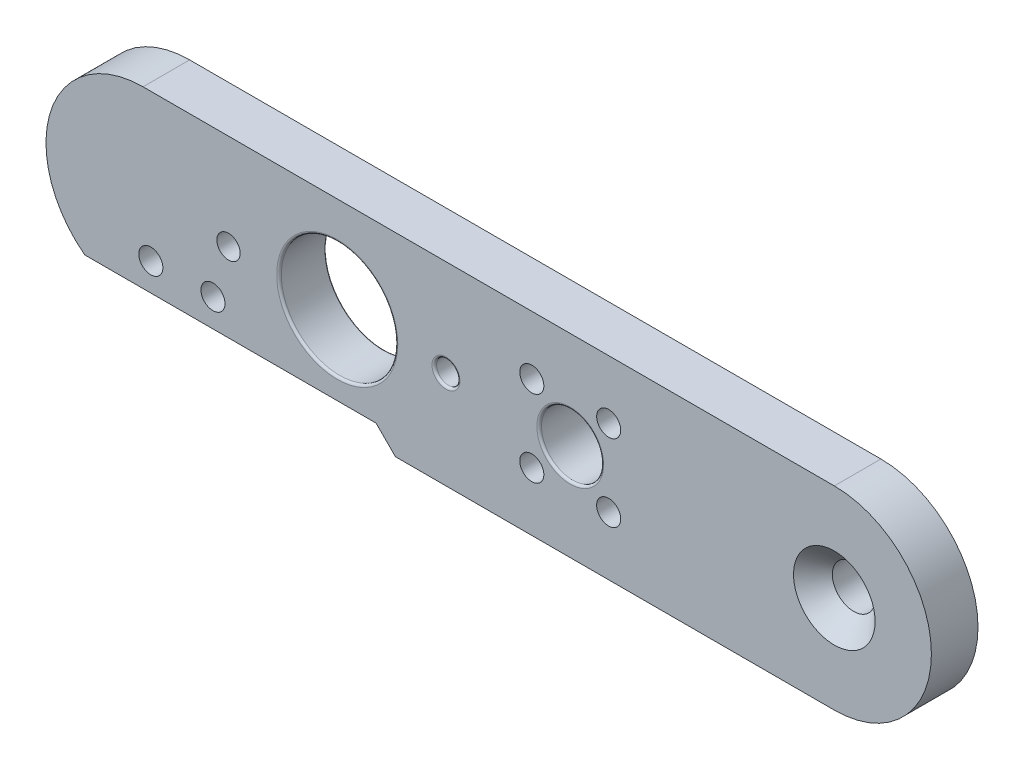
ISO-10303-21;
HEADER;
FILE_DESCRIPTION(('STEP AP214'),'2;1');
FILE_NAME('part.step','',(''),(''),'','','');
FILE_SCHEMA(('AUTOMOTIVE_DESIGN { 1 0 10303 214 1 1 1 1 }'));
ENDSEC;
DATA;
#1=APPLICATION_CONTEXT('core data for automotive mechanical design processes');
#2=APPLICATION_PROTOCOL_DEFINITION('international standard','automotive_design',2000,#1);
#3=PRODUCT_CONTEXT('',#1,'mechanical');
#4=PRODUCT('Part','Part','',(#3));
#5=PRODUCT_RELATED_PRODUCT_CATEGORY('part','',(#4));
#6=PRODUCT_DEFINITION_FORMATION('','',#4);
#7=PRODUCT_DEFINITION_CONTEXT('part definition',#1,'design');
#8=PRODUCT_DEFINITION('design','',#6,#7);
#9=PRODUCT_DEFINITION_SHAPE('','',#8);
#10=(LENGTH_UNIT() NAMED_UNIT(*) SI_UNIT(.MILLI.,.METRE.));
#11=(NAMED_UNIT(*) PLANE_ANGLE_UNIT() SI_UNIT($,.RADIAN.));
#12=(NAMED_UNIT(*) SI_UNIT($,.STERADIAN.) SOLID_ANGLE_UNIT());
#13=UNCERTAINTY_MEASURE_WITH_UNIT(LENGTH_MEASURE(1.E-05),#10,'distance_accuracy_value','');
#14=(GEOMETRIC_REPRESENTATION_CONTEXT(3) GLOBAL_UNCERTAINTY_ASSIGNED_CONTEXT((#13)) GLOBAL_UNIT_ASSIGNED_CONTEXT((#10,
#11,#12)) REPRESENTATION_CONTEXT('',''));
#15=CARTESIAN_POINT('',(0.,0.,0.));
#16=DIRECTION('',(0.,0.,1.));
#17=DIRECTION('',(1.,0.,0.));
#18=AXIS2_PLACEMENT_3D('',#15,#16,#17);
#19=CARTESIAN_POINT('',(-44.5,0.,6.));
#20=DIRECTION('',(0.,0.,-1.));
#21=DIRECTION('',(-1.,0.,0.));
#22=AXIS2_PLACEMENT_3D('',#19,#20,#21);
#23=CYLINDRICAL_SURFACE('',#22,12.5);
#24=DIRECTION('',(0.,0.,1.));
#25=VECTOR('',#24,1.);
#26=CARTESIAN_POINT('',(-52.,-9.99999999999998,0.));
#27=LINE('',#26,#25);
#28=CARTESIAN_POINT('',(-52.0000000000002,-9.9999999999999,0.));
#29=VERTEX_POINT('',#28);
#30=CARTESIAN_POINT('',(-52.,-9.99999999999998,6.));
#31=VERTEX_POINT('',#30);
#32=EDGE_CURVE('E86',#29,#31,#27,.T.);
#33=ORIENTED_EDGE('',*,*,#32,.T.);
#34=CARTESIAN_POINT('',(-44.5,0.,6.));
#35=DIRECTION('',(0.,0.,1.));
#36=DIRECTION('',(1.,0.,0.));
#37=AXIS2_PLACEMENT_3D('',#34,#35,#36);
#38=CIRCLE('',#37,12.5);
#39=CARTESIAN_POINT('',(-44.5,12.5,6.));
#40=VERTEX_POINT('',#39);
#41=EDGE_CURVE('E173',#40,#31,#38,.T.);
#42=ORIENTED_EDGE('',*,*,#41,.F.);
#43=DIRECTION('',(0.,0.,-1.));
#44=VECTOR('',#43,1.);
#45=CARTESIAN_POINT('',(-44.5,12.5,6.));
#46=LINE('',#45,#44);
#47=CARTESIAN_POINT('',(-44.5,12.5,0.));
#48=VERTEX_POINT('',#47);
#49=EDGE_CURVE('E183',#40,#48,#46,.T.);
#50=ORIENTED_EDGE('',*,*,#49,.T.);
#51=CARTESIAN_POINT('',(-44.5,0.,0.));
#52=DIRECTION('',(0.,0.,1.));
#53=DIRECTION('',(1.,0.,0.));
#54=AXIS2_PLACEMENT_3D('',#51,#52,#53);
#55=CIRCLE('',#54,12.5);
#56=EDGE_CURVE('E170',#48,#29,#55,.T.);
#57=ORIENTED_EDGE('',*,*,#56,.T.);
#58=EDGE_LOOP('',(#33,#42,#50,#57));
#59=FACE_BOUND('',#58,.T.);
#60=ADVANCED_FACE('F70',(#59),#23,.T.);
#61=CARTESIAN_POINT('',(-44.5,-12.5,6.));
#62=DIRECTION('',(0.,1.,0.));
#63=DIRECTION('',(-1.,0.,0.));
#64=AXIS2_PLACEMENT_3D('',#61,#62,#63);
#65=PLANE('',#64);
#66=DIRECTION('',(0.,0.,1.));
#67=VECTOR('',#66,1.);
#68=CARTESIAN_POINT('',(-12.,-12.5,0.));
#69=LINE('',#68,#67);
#70=CARTESIAN_POINT('',(-12.,-12.5,0.));
#71=VERTEX_POINT('',#70);
#72=CARTESIAN_POINT('',(-12.,-12.5,6.));
#73=VERTEX_POINT('',#72);
#74=EDGE_CURVE('E167',#71,#73,#69,.T.);
#75=ORIENTED_EDGE('',*,*,#74,.F.);
#76=DIRECTION('',(1.,0.,0.));
#77=VECTOR('',#76,1.);
#78=CARTESIAN_POINT('',(-44.5,-12.5,0.));
#79=LINE('',#78,#77);
#80=CARTESIAN_POINT('',(44.5,-12.5,0.));
#81=VERTEX_POINT('',#80);
#82=EDGE_CURVE('E153',#71,#81,#79,.T.);
#83=ORIENTED_EDGE('',*,*,#82,.T.);
#84=DIRECTION('',(0.,0.,-1.));
#85=VECTOR('',#84,1.);
#86=CARTESIAN_POINT('',(44.5,-12.5,6.));
#87=LINE('',#86,#85);
#88=CARTESIAN_POINT('',(44.5,-12.5,6.));
#89=VERTEX_POINT('',#88);
#90=EDGE_CURVE('E198',#89,#81,#87,.T.);
#91=ORIENTED_EDGE('',*,*,#90,.F.);
#92=DIRECTION('',(1.,0.,0.));
#93=VECTOR('',#92,1.);
#94=CARTESIAN_POINT('',(-44.5,-12.5,6.));
#95=LINE('',#94,#93);
#96=EDGE_CURVE('E117',#73,#89,#95,.T.);
#97=ORIENTED_EDGE('',*,*,#96,.F.);
#98=EDGE_LOOP('',(#75,#83,#91,#97));
#99=FACE_BOUND('',#98,.T.);
#100=ADVANCED_FACE('F261',(#99),#65,.F.);
#101=CARTESIAN_POINT('',(-44.5,0.,6.));
#102=DIRECTION('',(0.,0.,1.));
#103=DIRECTION('',(1.,0.,0.));
#104=AXIS2_PLACEMENT_3D('',#101,#102,#103);
#105=PLANE('',#104);
#106=CARTESIAN_POINT('',(10.5,0.,6.));
#107=DIRECTION('',(0.,0.,1.));
#108=DIRECTION('',(1.,0.,0.));
#109=AXIS2_PLACEMENT_3D('',#106,#107,#108);
#110=CIRCLE('',#109,4.30000000000001);
#111=CARTESIAN_POINT('',(14.8,0.,6.));
#112=VERTEX_POINT('',#111);
#113=EDGE_CURVE('E230',#112,#112,#110,.F.);
#114=ORIENTED_EDGE('',*,*,#113,.T.);
#115=EDGE_LOOP('',(#114));
#116=FACE_BOUND('',#115,.T.);
#117=CARTESIAN_POINT('',(-5.50015578929164,0.0828288287098955,6.));
#118=DIRECTION('',(0.,0.,1.));
#119=DIRECTION('',(1.,0.,0.));
#120=AXIS2_PLACEMENT_3D('',#117,#118,#119);
#121=CIRCLE('',#120,1.8);
#122=CARTESIAN_POINT('',(-3.70015578929164,0.0828288287098955,6.));
#123=VERTEX_POINT('',#122);
#124=EDGE_CURVE('E226',#123,#123,#121,.F.);
#125=ORIENTED_EDGE('',*,*,#124,.T.);
#126=EDGE_LOOP('',(#125));
#127=FACE_BOUND('',#126,.T.);
#128=CARTESIAN_POINT('',(-19.5,0.1762321266267,6.));
#129=DIRECTION('',(0.,0.,1.));
#130=DIRECTION('',(1.,0.,0.));
#131=AXIS2_PLACEMENT_3D('',#128,#129,#130);
#132=CIRCLE('',#131,7.8);
#133=CARTESIAN_POINT('',(-11.7,0.1762321266267,6.));
#134=VERTEX_POINT('',#133);
#135=EDGE_CURVE('E222',#134,#134,#132,.F.);
#136=ORIENTED_EDGE('',*,*,#135,.T.);
#137=EDGE_LOOP('',(#136));
#138=FACE_BOUND('',#137,.T.);
#139=CARTESIAN_POINT('',(44.5,0.,6.));
#140=DIRECTION('',(0.,0.,1.));
#141=DIRECTION('',(1.,0.,0.));
#142=AXIS2_PLACEMENT_3D('',#139,#140,#141);
#143=CIRCLE('',#142,5.25);
#144=CARTESIAN_POINT('',(49.75,0.,6.));
#145=VERTEX_POINT('',#144);
#146=EDGE_CURVE('E432',#145,#145,#143,.T.);
#147=ORIENTED_EDGE('',*,*,#146,.F.);
#148=EDGE_LOOP('',(#147));
#149=FACE_BOUND('',#148,.T.);
#150=CARTESIAN_POINT('',(-43.5,-6.41374283085084,6.));
#151=DIRECTION('',(0.,0.,1.));
#152=DIRECTION('',(1.,0.,0.));
#153=AXIS2_PLACEMENT_3D('',#150,#151,#152);
#154=CIRCLE('',#153,1.55);
#155=CARTESIAN_POINT('',(-41.95,-6.41374283085084,6.));
#156=VERTEX_POINT('',#155);
#157=EDGE_CURVE('E378',#156,#156,#154,.T.);
#158=ORIENTED_EDGE('',*,*,#157,.F.);
#159=EDGE_LOOP('',(#158));
#160=FACE_BOUND('',#159,.T.);
#161=CARTESIAN_POINT('',(-35.5,-6.41374283085084,6.));
#162=DIRECTION('',(0.,0.,1.));
#163=DIRECTION('',(1.,0.,0.));
#164=AXIS2_PLACEMENT_3D('',#161,#162,#163);
#165=CIRCLE('',#164,1.55);
#166=CARTESIAN_POINT('',(-33.95,-6.41374283085084,6.));
#167=VERTEX_POINT('',#166);
#168=EDGE_CURVE('E384',#167,#167,#165,.T.);
#169=ORIENTED_EDGE('',*,*,#168,.F.);
#170=EDGE_LOOP('',(#169));
#171=FACE_BOUND('',#170,.T.);
#172=CARTESIAN_POINT('',(-33.5,0.176232126626699,6.));
#173=DIRECTION('',(0.,0.,1.));
#174=DIRECTION('',(1.,0.,0.));
#175=AXIS2_PLACEMENT_3D('',#172,#173,#174);
#176=CIRCLE('',#175,1.5);
#177=CARTESIAN_POINT('',(-32.,0.176232126626699,6.));
#178=VERTEX_POINT('',#177);
#179=EDGE_CURVE('E372',#178,#178,#176,.T.);
#180=ORIENTED_EDGE('',*,*,#179,.F.);
#181=EDGE_LOOP('',(#180));
#182=FACE_BOUND('',#181,.T.);
#183=CARTESIAN_POINT('',(5.55025253169416,4.94974746830582,6.));
#184=DIRECTION('',(0.,0.,1.));
#185=DIRECTION('',(1.,0.,0.));
#186=AXIS2_PLACEMENT_3D('',#183,#184,#185);
#187=CIRCLE('',#186,1.55);
#188=CARTESIAN_POINT('',(7.10025253169416,4.94974746830582,6.));
#189=VERTEX_POINT('',#188);
#190=EDGE_CURVE('E336',#189,#189,#187,.T.);
#191=ORIENTED_EDGE('',*,*,#190,.F.);
#192=EDGE_LOOP('',(#191));
#193=FACE_BOUND('',#192,.T.);
#194=CARTESIAN_POINT('',(15.4497474683058,4.94974746830596,6.));
#195=DIRECTION('',(0.,0.,1.));
#196=DIRECTION('',(1.,0.,0.));
#197=AXIS2_PLACEMENT_3D('',#194,#195,#196);
#198=CIRCLE('',#197,1.55);
#199=CARTESIAN_POINT('',(16.9997474683058,4.94974746830596,6.));
#200=VERTEX_POINT('',#199);
#201=EDGE_CURVE('E165',#200,#200,#198,.T.);
#202=ORIENTED_EDGE('',*,*,#201,.F.);
#203=EDGE_LOOP('',(#202));
#204=FACE_BOUND('',#203,.T.);
#205=CARTESIAN_POINT('',(15.4497474683059,-4.94974746830572,6.));
#206=DIRECTION('',(0.,0.,1.));
#207=DIRECTION('',(1.,0.,0.));
#208=AXIS2_PLACEMENT_3D('',#205,#206,#207);
#209=CIRCLE('',#208,1.55);
#210=CARTESIAN_POINT('',(16.999747468306,-4.94974746830572,6.));
#211=VERTEX_POINT('',#210);
#212=EDGE_CURVE('E351',#211,#211,#209,.T.);
#213=ORIENTED_EDGE('',*,*,#212,.F.);
#214=EDGE_LOOP('',(#213));
#215=FACE_BOUND('',#214,.T.);
#216=CARTESIAN_POINT('',(5.55025253169426,-4.94974746830579,6.));
#217=DIRECTION('',(0.,0.,1.));
#218=DIRECTION('',(1.,0.,0.));
#219=AXIS2_PLACEMENT_3D('',#216,#217,#218);
#220=CIRCLE('',#219,1.55);
#221=CARTESIAN_POINT('',(7.10025253169426,-4.94974746830579,6.));
#222=VERTEX_POINT('',#221);
#223=EDGE_CURVE('E335',#222,#222,#220,.T.);
#224=ORIENTED_EDGE('',*,*,#223,.F.);
#225=EDGE_LOOP('',(#224));
#226=FACE_BOUND('',#225,.T.);
#227=DIRECTION('',(1.,0.,0.));
#228=VECTOR('',#227,1.);
#229=CARTESIAN_POINT('',(0.,-10.,6.));
#230=LINE('',#229,#228);
#231=CARTESIAN_POINT('',(-14.5,-9.99999999999999,6.));
#232=VERTEX_POINT('',#231);
#233=EDGE_CURVE('E155',#31,#232,#230,.T.);
#234=ORIENTED_EDGE('',*,*,#233,.T.);
#235=DIRECTION('',(0.707106781186551,-0.707106781186544,0.));
#236=VECTOR('',#235,1.);
#237=CARTESIAN_POINT('',(-12.2499999999999,-12.25,6.));
#238=LINE('',#237,#236);
#239=EDGE_CURVE('E146',#232,#73,#238,.T.);
#240=ORIENTED_EDGE('',*,*,#239,.T.);
#241=ORIENTED_EDGE('',*,*,#96,.T.);
#242=CARTESIAN_POINT('',(44.5,0.,6.));
#243=DIRECTION('',(0.,0.,1.));
#244=DIRECTION('',(1.,0.,0.));
#245=AXIS2_PLACEMENT_3D('',#242,#243,#244);
#246=CIRCLE('',#245,12.5);
#247=CARTESIAN_POINT('',(44.5,12.5,6.));
#248=VERTEX_POINT('',#247);
#249=EDGE_CURVE('E178',#89,#248,#246,.T.);
#250=ORIENTED_EDGE('',*,*,#249,.T.);
#251=DIRECTION('',(-1.,0.,0.));
#252=VECTOR('',#251,1.);
#253=CARTESIAN_POINT('',(-44.5,12.5,6.));
#254=LINE('',#253,#252);
#255=EDGE_CURVE('E95',#248,#40,#254,.T.);
#256=ORIENTED_EDGE('',*,*,#255,.T.);
#257=ORIENTED_EDGE('',*,*,#41,.T.);
#258=EDGE_LOOP('',(#234,#240,#241,#250,#256,#257));
#259=FACE_BOUND('',#258,.T.);
#260=ADVANCED_FACE('F267',(#116,#127,#138,#149,#160,#171,#182,#193,#204,#215,#226,#259),#105,.T.);
#261=CARTESIAN_POINT('',(-44.5,0.,0.));
#262=DIRECTION('',(0.,0.,1.));
#263=DIRECTION('',(1.,0.,0.));
#264=AXIS2_PLACEMENT_3D('',#261,#262,#263);
#265=PLANE('',#264);
#266=CARTESIAN_POINT('',(-5.50015578929164,0.0828288287098955,0.));
#267=DIRECTION('',(0.,0.,1.));
#268=DIRECTION('',(1.,0.,0.));
#269=AXIS2_PLACEMENT_3D('',#266,#267,#268);
#270=CIRCLE('',#269,1.8);
#271=CARTESIAN_POINT('',(-3.70015578929164,0.0828288287098955,0.));
#272=VERTEX_POINT('',#271);
#273=EDGE_CURVE('E79',#272,#272,#270,.T.);
#274=ORIENTED_EDGE('',*,*,#273,.T.);
#275=EDGE_LOOP('',(#274));
#276=FACE_BOUND('',#275,.T.);
#277=CARTESIAN_POINT('',(-19.5,0.1762321266267,0.));
#278=DIRECTION('',(0.,0.,1.));
#279=DIRECTION('',(1.,0.,0.));
#280=AXIS2_PLACEMENT_3D('',#277,#278,#279);
#281=CIRCLE('',#280,7.6);
#282=CARTESIAN_POINT('',(-11.9,0.1762321266267,0.));
#283=VERTEX_POINT('',#282);
#284=EDGE_CURVE('E206',#283,#283,#281,.T.);
#285=ORIENTED_EDGE('',*,*,#284,.T.);
#286=EDGE_LOOP('',(#285));
#287=FACE_BOUND('',#286,.T.);
#288=CARTESIAN_POINT('',(10.5,0.,0.));
#289=DIRECTION('',(0.,0.,1.));
#290=DIRECTION('',(1.,0.,0.));
#291=AXIS2_PLACEMENT_3D('',#288,#289,#290);
#292=CIRCLE('',#291,4.10000000000001);
#293=CARTESIAN_POINT('',(14.6,0.,0.));
#294=VERTEX_POINT('',#293);
#295=EDGE_CURVE('E202',#294,#294,#292,.T.);
#296=ORIENTED_EDGE('',*,*,#295,.T.);
#297=EDGE_LOOP('',(#296));
#298=FACE_BOUND('',#297,.T.);
#299=CARTESIAN_POINT('',(44.5,0.,0.));
#300=DIRECTION('',(0.,0.,1.));
#301=DIRECTION('',(1.,0.,0.));
#302=AXIS2_PLACEMENT_3D('',#299,#300,#301);
#303=CIRCLE('',#302,2.75);
#304=CARTESIAN_POINT('',(47.25,0.,0.));
#305=VERTEX_POINT('',#304);
#306=EDGE_CURVE('E306',#305,#305,#303,.T.);
#307=ORIENTED_EDGE('',*,*,#306,.T.);
#308=EDGE_LOOP('',(#307));
#309=FACE_BOUND('',#308,.T.);
#310=CARTESIAN_POINT('',(-43.5,-6.41374283085084,0.));
#311=DIRECTION('',(0.,0.,1.));
#312=DIRECTION('',(1.,0.,0.));
#313=AXIS2_PLACEMENT_3D('',#310,#311,#312);
#314=CIRCLE('',#313,2.99999999999999);
#315=CARTESIAN_POINT('',(-40.5,-6.41374283085084,0.));
#316=VERTEX_POINT('',#315);
#317=EDGE_CURVE('E310',#316,#316,#314,.T.);
#318=ORIENTED_EDGE('',*,*,#317,.T.);
#319=EDGE_LOOP('',(#318));
#320=FACE_BOUND('',#319,.T.);
#321=CARTESIAN_POINT('',(-35.5,-6.41374283085084,0.));
#322=DIRECTION('',(0.,0.,1.));
#323=DIRECTION('',(1.,0.,0.));
#324=AXIS2_PLACEMENT_3D('',#321,#322,#323);
#325=CIRCLE('',#324,2.99999999999999);
#326=CARTESIAN_POINT('',(-32.5,-6.41374283085084,0.));
#327=VERTEX_POINT('',#326);
#328=EDGE_CURVE('E314',#327,#327,#325,.T.);
#329=ORIENTED_EDGE('',*,*,#328,.T.);
#330=EDGE_LOOP('',(#329));
#331=FACE_BOUND('',#330,.T.);
#332=CARTESIAN_POINT('',(-33.5,0.176232126626699,0.));
#333=DIRECTION('',(0.,0.,1.));
#334=DIRECTION('',(1.,0.,0.));
#335=AXIS2_PLACEMENT_3D('',#332,#333,#334);
#336=CIRCLE('',#335,1.5);
#337=CARTESIAN_POINT('',(-32.,0.176232126626699,0.));
#338=VERTEX_POINT('',#337);
#339=EDGE_CURVE('E318',#338,#338,#336,.T.);
#340=ORIENTED_EDGE('',*,*,#339,.T.);
#341=EDGE_LOOP('',(#340));
#342=FACE_BOUND('',#341,.T.);
#343=CARTESIAN_POINT('',(5.55025253169416,4.94974746830582,0.));
#344=DIRECTION('',(0.,0.,1.));
#345=DIRECTION('',(1.,0.,0.));
#346=AXIS2_PLACEMENT_3D('',#343,#344,#345);
#347=CIRCLE('',#346,1.55);
#348=CARTESIAN_POINT('',(7.10025253169416,4.94974746830582,0.));
#349=VERTEX_POINT('',#348);
#350=EDGE_CURVE('E322',#349,#349,#347,.T.);
#351=ORIENTED_EDGE('',*,*,#350,.T.);
#352=EDGE_LOOP('',(#351));
#353=FACE_BOUND('',#352,.T.);
#354=CARTESIAN_POINT('',(15.4497474683058,4.94974746830596,0.));
#355=DIRECTION('',(0.,0.,1.));
#356=DIRECTION('',(1.,0.,0.));
#357=AXIS2_PLACEMENT_3D('',#354,#355,#356);
#358=CIRCLE('',#357,1.55);
#359=CARTESIAN_POINT('',(16.9997474683058,4.94974746830596,0.));
#360=VERTEX_POINT('',#359);
#361=EDGE_CURVE('E326',#360,#360,#358,.T.);
#362=ORIENTED_EDGE('',*,*,#361,.T.);
#363=EDGE_LOOP('',(#362));
#364=FACE_BOUND('',#363,.T.);
#365=CARTESIAN_POINT('',(15.4497474683059,-4.94974746830572,0.));
#366=DIRECTION('',(0.,0.,1.));
#367=DIRECTION('',(1.,0.,0.));
#368=AXIS2_PLACEMENT_3D('',#365,#366,#367);
#369=CIRCLE('',#368,1.55);
#370=CARTESIAN_POINT('',(16.999747468306,-4.94974746830572,0.));
#371=VERTEX_POINT('',#370);
#372=EDGE_CURVE('E161',#371,#371,#369,.T.);
#373=ORIENTED_EDGE('',*,*,#372,.T.);
#374=EDGE_LOOP('',(#373));
#375=FACE_BOUND('',#374,.T.);
#376=CARTESIAN_POINT('',(5.55025253169426,-4.94974746830579,0.));
#377=DIRECTION('',(0.,0.,1.));
#378=DIRECTION('',(1.,0.,0.));
#379=AXIS2_PLACEMENT_3D('',#376,#377,#378);
#380=CIRCLE('',#379,1.55);
#381=CARTESIAN_POINT('',(7.10025253169426,-4.94974746830579,0.));
#382=VERTEX_POINT('',#381);
#383=EDGE_CURVE('E332',#382,#382,#380,.T.);
#384=ORIENTED_EDGE('',*,*,#383,.T.);
#385=EDGE_LOOP('',(#384));
#386=FACE_BOUND('',#385,.T.);
#387=DIRECTION('',(0.707106781186551,-0.707106781186544,0.));
#388=VECTOR('',#387,1.);
#389=CARTESIAN_POINT('',(-12.2499999999999,-12.25,0.));
#390=LINE('',#389,#388);
#391=CARTESIAN_POINT('',(-14.5,-9.99999999999999,0.));
#392=VERTEX_POINT('',#391);
#393=EDGE_CURVE('E141',#392,#71,#390,.T.);
#394=ORIENTED_EDGE('',*,*,#393,.F.);
#395=DIRECTION('',(1.,0.,0.));
#396=VECTOR('',#395,1.);
#397=CARTESIAN_POINT('',(0.,-10.,0.));
#398=LINE('',#397,#396);
#399=EDGE_CURVE('E131',#29,#392,#398,.T.);
#400=ORIENTED_EDGE('',*,*,#399,.F.);
#401=ORIENTED_EDGE('',*,*,#56,.F.);
#402=DIRECTION('',(-1.,0.,0.));
#403=VECTOR('',#402,1.);
#404=CARTESIAN_POINT('',(-44.5,12.5,0.));
#405=LINE('',#404,#403);
#406=CARTESIAN_POINT('',(44.5,12.5,0.));
#407=VERTEX_POINT('',#406);
#408=EDGE_CURVE('E112',#407,#48,#405,.T.);
#409=ORIENTED_EDGE('',*,*,#408,.F.);
#410=CARTESIAN_POINT('',(44.5,0.,0.));
#411=DIRECTION('',(0.,0.,1.));
#412=DIRECTION('',(1.,0.,0.));
#413=AXIS2_PLACEMENT_3D('',#410,#411,#412);
#414=CIRCLE('',#413,12.5);
#415=EDGE_CURVE('E188',#81,#407,#414,.T.);
#416=ORIENTED_EDGE('',*,*,#415,.F.);
#417=ORIENTED_EDGE('',*,*,#82,.F.);
#418=EDGE_LOOP('',(#394,#400,#401,#409,#416,#417));
#419=FACE_BOUND('',#418,.T.);
#420=ADVANCED_FACE('F151',(#276,#287,#298,#309,#320,#331,#342,#353,#364,#375,#386,#419),#265,.F.);
#421=CARTESIAN_POINT('',(44.5,0.,6.));
#422=DIRECTION('',(0.,0.,-1.));
#423=DIRECTION('',(-1.,0.,0.));
#424=AXIS2_PLACEMENT_3D('',#421,#422,#423);
#425=CYLINDRICAL_SURFACE('',#424,12.5);
#426=ORIENTED_EDGE('',*,*,#415,.T.);
#427=DIRECTION('',(0.,0.,-1.));
#428=VECTOR('',#427,1.);
#429=CARTESIAN_POINT('',(44.5,12.5,6.));
#430=LINE('',#429,#428);
#431=EDGE_CURVE('E195',#248,#407,#430,.T.);
#432=ORIENTED_EDGE('',*,*,#431,.F.);
#433=ORIENTED_EDGE('',*,*,#249,.F.);
#434=ORIENTED_EDGE('',*,*,#90,.T.);
#435=EDGE_LOOP('',(#426,#432,#433,#434));
#436=FACE_BOUND('',#435,.T.);
#437=ADVANCED_FACE('F301',(#436),#425,.T.);
#438=CARTESIAN_POINT('',(-44.5,12.5,6.));
#439=DIRECTION('',(0.,-1.,0.));
#440=DIRECTION('',(1.,0.,0.));
#441=AXIS2_PLACEMENT_3D('',#438,#439,#440);
#442=PLANE('',#441);
#443=ORIENTED_EDGE('',*,*,#408,.T.);
#444=ORIENTED_EDGE('',*,*,#49,.F.);
#445=ORIENTED_EDGE('',*,*,#255,.F.);
#446=ORIENTED_EDGE('',*,*,#431,.T.);
#447=EDGE_LOOP('',(#443,#444,#445,#446));
#448=FACE_BOUND('',#447,.T.);
#449=ADVANCED_FACE('F461',(#448),#442,.F.);
#450=CARTESIAN_POINT('',(-12.2499999999999,-12.25,0.));
#451=DIRECTION('',(-0.707106781186544,-0.707106781186551,0.));
#452=DIRECTION('',(0.707106781186551,-0.707106781186544,0.));
#453=AXIS2_PLACEMENT_3D('',#450,#451,#452);
#454=PLANE('',#453);
#455=ORIENTED_EDGE('',*,*,#239,.F.);
#456=DIRECTION('',(0.,0.,1.));
#457=VECTOR('',#456,1.);
#458=CARTESIAN_POINT('',(-14.5,-9.99999999999999,0.));
#459=LINE('',#458,#457);
#460=EDGE_CURVE('E134',#392,#232,#459,.T.);
#461=ORIENTED_EDGE('',*,*,#460,.F.);
#462=ORIENTED_EDGE('',*,*,#393,.T.);
#463=ORIENTED_EDGE('',*,*,#74,.T.);
#464=EDGE_LOOP('',(#455,#461,#462,#463));
#465=FACE_BOUND('',#464,.T.);
#466=ADVANCED_FACE('F144',(#465),#454,.T.);
#467=CARTESIAN_POINT('',(0.,-10.,0.));
#468=DIRECTION('',(0.,-1.,0.));
#469=DIRECTION('',(1.,0.,0.));
#470=AXIS2_PLACEMENT_3D('',#467,#468,#469);
#471=PLANE('',#470);
#472=ORIENTED_EDGE('',*,*,#233,.F.);
#473=ORIENTED_EDGE('',*,*,#32,.F.);
#474=ORIENTED_EDGE('',*,*,#399,.T.);
#475=ORIENTED_EDGE('',*,*,#460,.T.);
#476=EDGE_LOOP('',(#472,#473,#474,#475));
#477=FACE_BOUND('',#476,.T.);
#478=ADVANCED_FACE('F133',(#477),#471,.T.);
#479=CARTESIAN_POINT('',(5.55025253169426,-4.94974746830579,0.));
#480=DIRECTION('',(0.,0.,1.));
#481=DIRECTION('',(1.,0.,0.));
#482=AXIS2_PLACEMENT_3D('',#479,#480,#481);
#483=CYLINDRICAL_SURFACE('',#482,1.55);
#484=ORIENTED_EDGE('',*,*,#383,.F.);
#485=EDGE_LOOP('',(#484));
#486=FACE_BOUND('',#485,.T.);
#487=ORIENTED_EDGE('',*,*,#223,.T.);
#488=EDGE_LOOP('',(#487));
#489=FACE_BOUND('',#488,.T.);
#490=ADVANCED_FACE('F293',(#486,#489),#483,.F.);
#491=CARTESIAN_POINT('',(10.5,0.,0.));
#492=DIRECTION('',(0.,0.,1.));
#493=DIRECTION('',(1.,0.,0.));
#494=AXIS2_PLACEMENT_3D('',#491,#492,#493);
#495=CYLINDRICAL_SURFACE('',#494,4.00000000000001);
#496=CARTESIAN_POINT('',(10.5,0.,5.7));
#497=DIRECTION('',(0.,0.,1.));
#498=DIRECTION('',(1.,0.,0.));
#499=AXIS2_PLACEMENT_3D('',#496,#497,#498);
#500=CIRCLE('',#499,4.00000000000001);
#501=CARTESIAN_POINT('',(14.5,0.,5.7));
#502=VERTEX_POINT('',#501);
#503=EDGE_CURVE('E218',#502,#502,#500,.T.);
#504=ORIENTED_EDGE('',*,*,#503,.T.);
#505=EDGE_LOOP('',(#504));
#506=FACE_BOUND('',#505,.T.);
#507=CARTESIAN_POINT('',(10.5,0.,0.1));
#508=DIRECTION('',(0.,0.,1.));
#509=DIRECTION('',(1.,0.,0.));
#510=AXIS2_PLACEMENT_3D('',#507,#508,#509);
#511=CIRCLE('',#510,4.00000000000001);
#512=CARTESIAN_POINT('',(14.5,0.,0.1));
#513=VERTEX_POINT('',#512);
#514=EDGE_CURVE('E214',#513,#513,#511,.F.);
#515=ORIENTED_EDGE('',*,*,#514,.T.);
#516=EDGE_LOOP('',(#515));
#517=FACE_BOUND('',#516,.T.);
#518=ADVANCED_FACE('F289',(#506,#517),#495,.F.);
#519=CARTESIAN_POINT('',(15.4497474683059,-4.94974746830572,0.));
#520=DIRECTION('',(0.,0.,1.));
#521=DIRECTION('',(1.,0.,0.));
#522=AXIS2_PLACEMENT_3D('',#519,#520,#521);
#523=CYLINDRICAL_SURFACE('',#522,1.55);
#524=ORIENTED_EDGE('',*,*,#372,.F.);
#525=EDGE_LOOP('',(#524));
#526=FACE_BOUND('',#525,.T.);
#527=ORIENTED_EDGE('',*,*,#212,.T.);
#528=EDGE_LOOP('',(#527));
#529=FACE_BOUND('',#528,.T.);
#530=ADVANCED_FACE('F292',(#526,#529),#523,.F.);
#531=CARTESIAN_POINT('',(15.4497474683058,4.94974746830596,0.));
#532=DIRECTION('',(0.,0.,1.));
#533=DIRECTION('',(1.,0.,0.));
#534=AXIS2_PLACEMENT_3D('',#531,#532,#533);
#535=CYLINDRICAL_SURFACE('',#534,1.55);
#536=ORIENTED_EDGE('',*,*,#361,.F.);
#537=EDGE_LOOP('',(#536));
#538=FACE_BOUND('',#537,.T.);
#539=ORIENTED_EDGE('',*,*,#201,.T.);
#540=EDGE_LOOP('',(#539));
#541=FACE_BOUND('',#540,.T.);
#542=ADVANCED_FACE('F474',(#538,#541),#535,.F.);
#543=CARTESIAN_POINT('',(5.55025253169416,4.94974746830582,0.));
#544=DIRECTION('',(0.,0.,1.));
#545=DIRECTION('',(1.,0.,0.));
#546=AXIS2_PLACEMENT_3D('',#543,#544,#545);
#547=CYLINDRICAL_SURFACE('',#546,1.55);
#548=ORIENTED_EDGE('',*,*,#350,.F.);
#549=EDGE_LOOP('',(#548));
#550=FACE_BOUND('',#549,.T.);
#551=ORIENTED_EDGE('',*,*,#190,.T.);
#552=EDGE_LOOP('',(#551));
#553=FACE_BOUND('',#552,.T.);
#554=ADVANCED_FACE('F478',(#550,#553),#547,.F.);
#555=CARTESIAN_POINT('',(-19.5,0.1762321266267,0.));
#556=DIRECTION('',(0.,0.,1.));
#557=DIRECTION('',(1.,0.,0.));
#558=AXIS2_PLACEMENT_3D('',#555,#556,#557);
#559=CYLINDRICAL_SURFACE('',#558,7.5);
#560=CARTESIAN_POINT('',(-19.5,0.1762321266267,5.7));
#561=DIRECTION('',(0.,0.,1.));
#562=DIRECTION('',(1.,0.,0.));
#563=AXIS2_PLACEMENT_3D('',#560,#561,#562);
#564=CIRCLE('',#563,7.5);
#565=CARTESIAN_POINT('',(-12.,0.1762321266267,5.7));
#566=VERTEX_POINT('',#565);
#567=EDGE_CURVE('E12',#566,#566,#564,.T.);
#568=ORIENTED_EDGE('',*,*,#567,.T.);
#569=EDGE_LOOP('',(#568));
#570=FACE_BOUND('',#569,.T.);
#571=CARTESIAN_POINT('',(-19.5,0.1762321266267,0.1));
#572=DIRECTION('',(0.,0.,1.));
#573=DIRECTION('',(1.,0.,0.));
#574=AXIS2_PLACEMENT_3D('',#571,#572,#573);
#575=CIRCLE('',#574,7.5);
#576=CARTESIAN_POINT('',(-12.,0.1762321266267,0.1));
#577=VERTEX_POINT('',#576);
#578=EDGE_CURVE('E210',#577,#577,#575,.F.);
#579=ORIENTED_EDGE('',*,*,#578,.T.);
#580=EDGE_LOOP('',(#579));
#581=FACE_BOUND('',#580,.T.);
#582=ADVANCED_FACE('F484',(#570,#581),#559,.F.);
#583=CARTESIAN_POINT('',(-33.5,0.176232126626699,6.));
#584=DIRECTION('',(0.,0.,1.));
#585=DIRECTION('',(1.,0.,0.));
#586=AXIS2_PLACEMENT_3D('',#583,#584,#585);
#587=CYLINDRICAL_SURFACE('',#586,1.5);
#588=ORIENTED_EDGE('',*,*,#339,.F.);
#589=EDGE_LOOP('',(#588));
#590=FACE_BOUND('',#589,.T.);
#591=ORIENTED_EDGE('',*,*,#179,.T.);
#592=EDGE_LOOP('',(#591));
#593=FACE_BOUND('',#592,.T.);
#594=ADVANCED_FACE('F488',(#590,#593),#587,.F.);
#595=CARTESIAN_POINT('',(-5.50015578929164,0.0828288287098955,6.));
#596=DIRECTION('',(0.,0.,1.));
#597=DIRECTION('',(1.,0.,0.));
#598=AXIS2_PLACEMENT_3D('',#595,#596,#597);
#599=CYLINDRICAL_SURFACE('',#598,1.5);
#600=CARTESIAN_POINT('',(-5.50015578929164,0.0828288287098955,5.7));
#601=DIRECTION('',(0.,0.,1.));
#602=DIRECTION('',(1.,0.,0.));
#603=AXIS2_PLACEMENT_3D('',#600,#601,#602);
#604=CIRCLE('',#603,1.5);
#605=CARTESIAN_POINT('',(-4.00015578929164,0.0828288287098955,5.7));
#606=VERTEX_POINT('',#605);
#607=EDGE_CURVE('E238',#606,#606,#604,.T.);
#608=ORIENTED_EDGE('',*,*,#607,.T.);
#609=EDGE_LOOP('',(#608));
#610=FACE_BOUND('',#609,.T.);
#611=CARTESIAN_POINT('',(-5.50015578929164,0.0828288287098955,0.3));
#612=DIRECTION('',(0.,0.,1.));
#613=DIRECTION('',(1.,0.,0.));
#614=AXIS2_PLACEMENT_3D('',#611,#612,#613);
#615=CIRCLE('',#614,1.5);
#616=CARTESIAN_POINT('',(-4.00015578929164,0.0828288287098955,0.3));
#617=VERTEX_POINT('',#616);
#618=EDGE_CURVE('E234',#617,#617,#615,.F.);
#619=ORIENTED_EDGE('',*,*,#618,.T.);
#620=EDGE_LOOP('',(#619));
#621=FACE_BOUND('',#620,.T.);
#622=ADVANCED_FACE('F492',(#610,#621),#599,.F.);
#623=CARTESIAN_POINT('',(-35.5,-6.41374283085084,3.));
#624=DIRECTION('',(0.,0.,1.));
#625=DIRECTION('',(1.,0.,0.));
#626=AXIS2_PLACEMENT_3D('',#623,#624,#625);
#627=CYLINDRICAL_SURFACE('',#626,1.55);
#628=CARTESIAN_POINT('',(-35.5,-6.41374283085084,3.));
#629=DIRECTION('',(0.,0.,1.));
#630=DIRECTION('',(1.,0.,0.));
#631=AXIS2_PLACEMENT_3D('',#628,#629,#630);
#632=CIRCLE('',#631,1.55);
#633=CARTESIAN_POINT('',(-33.95,-6.41374283085084,3.));
#634=VERTEX_POINT('',#633);
#635=EDGE_CURVE('E390',#634,#634,#632,.T.);
#636=ORIENTED_EDGE('',*,*,#635,.F.);
#637=EDGE_LOOP('',(#636));
#638=FACE_BOUND('',#637,.T.);
#639=ORIENTED_EDGE('',*,*,#168,.T.);
#640=EDGE_LOOP('',(#639));
#641=FACE_BOUND('',#640,.T.);
#642=ADVANCED_FACE('F496',(#638,#641),#627,.F.);
#643=CARTESIAN_POINT('',(-43.5,-6.41374283085084,3.));
#644=DIRECTION('',(0.,0.,1.));
#645=DIRECTION('',(1.,0.,0.));
#646=AXIS2_PLACEMENT_3D('',#643,#644,#645);
#647=CYLINDRICAL_SURFACE('',#646,1.55);
#648=CARTESIAN_POINT('',(-43.5,-6.41374283085084,3.));
#649=DIRECTION('',(0.,0.,1.));
#650=DIRECTION('',(1.,0.,0.));
#651=AXIS2_PLACEMENT_3D('',#648,#649,#650);
#652=CIRCLE('',#651,1.55);
#653=CARTESIAN_POINT('',(-41.95,-6.41374283085084,3.));
#654=VERTEX_POINT('',#653);
#655=EDGE_CURVE('E396',#654,#654,#652,.T.);
#656=ORIENTED_EDGE('',*,*,#655,.F.);
#657=EDGE_LOOP('',(#656));
#658=FACE_BOUND('',#657,.T.);
#659=ORIENTED_EDGE('',*,*,#157,.T.);
#660=EDGE_LOOP('',(#659));
#661=FACE_BOUND('',#660,.T.);
#662=ADVANCED_FACE('F500',(#658,#661),#647,.F.);
#663=CARTESIAN_POINT('',(-35.5,-6.41374283085084,0.));
#664=DIRECTION('',(0.,0.,1.));
#665=DIRECTION('',(1.,0.,0.));
#666=AXIS2_PLACEMENT_3D('',#663,#664,#665);
#667=CYLINDRICAL_SURFACE('',#666,2.99999999999999);
#668=ORIENTED_EDGE('',*,*,#328,.F.);
#669=EDGE_LOOP('',(#668));
#670=FACE_BOUND('',#669,.T.);
#671=CARTESIAN_POINT('',(-35.5,-6.41374283085084,3.));
#672=DIRECTION('',(0.,0.,1.));
#673=DIRECTION('',(1.,0.,0.));
#674=AXIS2_PLACEMENT_3D('',#671,#672,#673);
#675=CIRCLE('',#674,2.99999999999999);
#676=CARTESIAN_POINT('',(-32.5,-6.41374283085084,3.));
#677=VERTEX_POINT('',#676);
#678=EDGE_CURVE('E412',#677,#677,#675,.T.);
#679=ORIENTED_EDGE('',*,*,#678,.T.);
#680=EDGE_LOOP('',(#679));
#681=FACE_BOUND('',#680,.T.);
#682=ADVANCED_FACE('F504',(#670,#681),#667,.F.);
#683=CARTESIAN_POINT('',(-35.5,-6.41374283085084,3.));
#684=DIRECTION('',(0.,0.,1.));
#685=DIRECTION('',(1.,0.,0.));
#686=AXIS2_PLACEMENT_3D('',#683,#684,#685);
#687=PLANE('',#686);
#688=ORIENTED_EDGE('',*,*,#635,.T.);
#689=EDGE_LOOP('',(#688));
#690=FACE_BOUND('',#689,.T.);
#691=ORIENTED_EDGE('',*,*,#678,.F.);
#692=EDGE_LOOP('',(#691));
#693=FACE_BOUND('',#692,.T.);
#694=ADVANCED_FACE('F506',(#690,#693),#687,.F.);
#695=CARTESIAN_POINT('',(-43.5,-6.41374283085084,0.));
#696=DIRECTION('',(0.,0.,1.));
#697=DIRECTION('',(1.,0.,0.));
#698=AXIS2_PLACEMENT_3D('',#695,#696,#697);
#699=CYLINDRICAL_SURFACE('',#698,2.99999999999999);
#700=ORIENTED_EDGE('',*,*,#317,.F.);
#701=EDGE_LOOP('',(#700));
#702=FACE_BOUND('',#701,.T.);
#703=CARTESIAN_POINT('',(-43.5,-6.41374283085084,3.));
#704=DIRECTION('',(0.,0.,1.));
#705=DIRECTION('',(1.,0.,0.));
#706=AXIS2_PLACEMENT_3D('',#703,#704,#705);
#707=CIRCLE('',#706,2.99999999999999);
#708=CARTESIAN_POINT('',(-40.5,-6.41374283085084,3.));
#709=VERTEX_POINT('',#708);
#710=EDGE_CURVE('E406',#709,#709,#707,.T.);
#711=ORIENTED_EDGE('',*,*,#710,.T.);
#712=EDGE_LOOP('',(#711));
#713=FACE_BOUND('',#712,.T.);
#714=ADVANCED_FACE('F509',(#702,#713),#699,.F.);
#715=CARTESIAN_POINT('',(-43.5,-6.41374283085084,3.));
#716=DIRECTION('',(0.,0.,1.));
#717=DIRECTION('',(1.,0.,0.));
#718=AXIS2_PLACEMENT_3D('',#715,#716,#717);
#719=PLANE('',#718);
#720=ORIENTED_EDGE('',*,*,#655,.T.);
#721=EDGE_LOOP('',(#720));
#722=FACE_BOUND('',#721,.T.);
#723=ORIENTED_EDGE('',*,*,#710,.F.);
#724=EDGE_LOOP('',(#723));
#725=FACE_BOUND('',#724,.T.);
#726=ADVANCED_FACE('F516',(#722,#725),#719,.F.);
#727=CARTESIAN_POINT('',(44.5,0.,6.));
#728=DIRECTION('',(0.,0.,1.));
#729=DIRECTION('',(1.,0.,0.));
#730=AXIS2_PLACEMENT_3D('',#727,#728,#729);
#731=CYLINDRICAL_SURFACE('',#730,2.74999999999999);
#732=ORIENTED_EDGE('',*,*,#306,.F.);
#733=EDGE_LOOP('',(#732));
#734=FACE_BOUND('',#733,.T.);
#735=CARTESIAN_POINT('',(44.5,0.,3.49999999999998));
#736=DIRECTION('',(0.,0.,1.));
#737=DIRECTION('',(1.,0.,0.));
#738=AXIS2_PLACEMENT_3D('',#735,#736,#737);
#739=CIRCLE('',#738,2.74999999999999);
#740=CARTESIAN_POINT('',(47.25,0.,3.49999999999998));
#741=VERTEX_POINT('',#740);
#742=EDGE_CURVE('E426',#741,#741,#739,.T.);
#743=ORIENTED_EDGE('',*,*,#742,.T.);
#744=EDGE_LOOP('',(#743));
#745=FACE_BOUND('',#744,.T.);
#746=ADVANCED_FACE('F520',(#734,#745),#731,.F.);
#747=CARTESIAN_POINT('',(44.5,0.,6.));
#748=DIRECTION('',(0.,0.,1.));
#749=DIRECTION('',(1.,0.,0.));
#750=AXIS2_PLACEMENT_3D('',#747,#748,#749);
#751=CONICAL_SURFACE('',#750,5.25,0.785398163397447);
#752=ORIENTED_EDGE('',*,*,#742,.F.);
#753=EDGE_LOOP('',(#752));
#754=FACE_BOUND('',#753,.T.);
#755=ORIENTED_EDGE('',*,*,#146,.T.);
#756=EDGE_LOOP('',(#755));
#757=FACE_BOUND('',#756,.T.);
#758=ADVANCED_FACE('F276',(#754,#757),#751,.F.);
#759=CARTESIAN_POINT('',(-19.5,0.1762321266267,0.1));
#760=DIRECTION('',(0.,0.,1.));
#761=DIRECTION('',(1.,0.,0.));
#762=AXIS2_PLACEMENT_3D('',#759,#760,#761);
#763=TOROIDAL_SURFACE('',#762,7.6,0.1);
#764=ORIENTED_EDGE('',*,*,#578,.F.);
#765=EDGE_LOOP('',(#764));
#766=FACE_BOUND('',#765,.T.);
#767=ORIENTED_EDGE('',*,*,#284,.F.);
#768=EDGE_LOOP('',(#767));
#769=FACE_BOUND('',#768,.T.);
#770=ADVANCED_FACE('F272',(#766,#769),#763,.T.);
#771=CARTESIAN_POINT('',(10.5,0.,0.1));
#772=DIRECTION('',(0.,0.,1.));
#773=DIRECTION('',(1.,0.,0.));
#774=AXIS2_PLACEMENT_3D('',#771,#772,#773);
#775=TOROIDAL_SURFACE('',#774,4.10000000000001,0.1);
#776=ORIENTED_EDGE('',*,*,#514,.F.);
#777=EDGE_LOOP('',(#776));
#778=FACE_BOUND('',#777,.T.);
#779=ORIENTED_EDGE('',*,*,#295,.F.);
#780=EDGE_LOOP('',(#779));
#781=FACE_BOUND('',#780,.T.);
#782=ADVANCED_FACE('F275',(#778,#781),#775,.T.);
#783=CARTESIAN_POINT('',(10.5,0.,5.7));
#784=DIRECTION('',(0.,0.,1.));
#785=DIRECTION('',(1.,0.,0.));
#786=AXIS2_PLACEMENT_3D('',#783,#784,#785);
#787=TOROIDAL_SURFACE('',#786,4.30000000000001,0.3);
#788=ORIENTED_EDGE('',*,*,#113,.F.);
#789=EDGE_LOOP('',(#788));
#790=FACE_BOUND('',#789,.T.);
#791=ORIENTED_EDGE('',*,*,#503,.F.);
#792=EDGE_LOOP('',(#791));
#793=FACE_BOUND('',#792,.T.);
#794=ADVANCED_FACE('F256',(#790,#793),#787,.T.);
#795=CARTESIAN_POINT('',(-5.50015578929164,0.0828288287098955,5.7));
#796=DIRECTION('',(0.,0.,1.));
#797=DIRECTION('',(1.,0.,0.));
#798=AXIS2_PLACEMENT_3D('',#795,#796,#797);
#799=TOROIDAL_SURFACE('',#798,1.8,0.3);
#800=ORIENTED_EDGE('',*,*,#124,.F.);
#801=EDGE_LOOP('',(#800));
#802=FACE_BOUND('',#801,.T.);
#803=ORIENTED_EDGE('',*,*,#607,.F.);
#804=EDGE_LOOP('',(#803));
#805=FACE_BOUND('',#804,.T.);
#806=ADVANCED_FACE('F249',(#802,#805),#799,.T.);
#807=CARTESIAN_POINT('',(-5.50015578929164,0.0828288287098955,0.3));
#808=DIRECTION('',(0.,0.,1.));
#809=DIRECTION('',(1.,0.,0.));
#810=AXIS2_PLACEMENT_3D('',#807,#808,#809);
#811=TOROIDAL_SURFACE('',#810,1.8,0.3);
#812=ORIENTED_EDGE('',*,*,#618,.F.);
#813=EDGE_LOOP('',(#812));
#814=FACE_BOUND('',#813,.T.);
#815=ORIENTED_EDGE('',*,*,#273,.F.);
#816=EDGE_LOOP('',(#815));
#817=FACE_BOUND('',#816,.T.);
#818=ADVANCED_FACE('F247',(#814,#817),#811,.T.);
#819=CARTESIAN_POINT('',(-19.5,0.1762321266267,5.7));
#820=DIRECTION('',(0.,0.,1.));
#821=DIRECTION('',(1.,0.,0.));
#822=AXIS2_PLACEMENT_3D('',#819,#820,#821);
#823=TOROIDAL_SURFACE('',#822,7.8,0.3);
#824=ORIENTED_EDGE('',*,*,#135,.F.);
#825=EDGE_LOOP('',(#824));
#826=FACE_BOUND('',#825,.T.);
#827=ORIENTED_EDGE('',*,*,#567,.F.);
#828=EDGE_LOOP('',(#827));
#829=FACE_BOUND('',#828,.T.);
#830=ADVANCED_FACE('F72',(#826,#829),#823,.T.);
#831=CLOSED_SHELL('',(#60,#100,#260,#420,#437,#449,#466,#478,#490,#518,#530,#542,#554,#582,#594,
#622,#642,#662,#682,#694,#714,#726,#746,#758,#770,#782,#794,#806,#818,#830));
#832=MANIFOLD_SOLID_BREP('B2',#831);
#833=ADVANCED_BREP_SHAPE_REPRESENTATION('',(#18,#832),#14);
#834=SHAPE_DEFINITION_REPRESENTATION(#9,#833);
ENDSEC;
END-ISO-10303-21;
